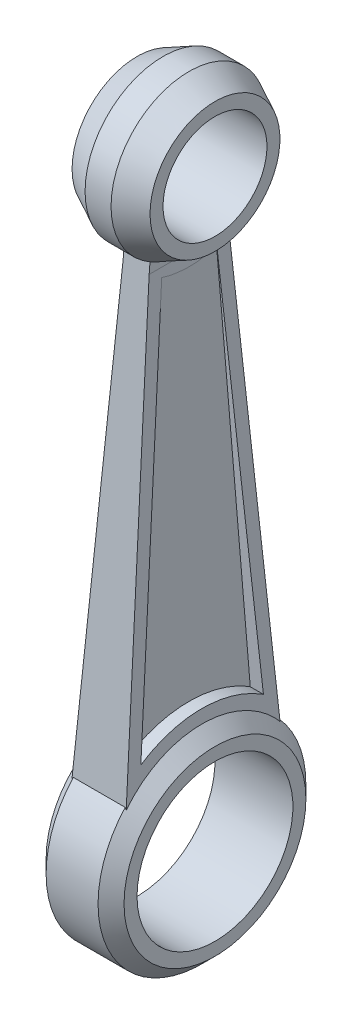
ISO-10303-21;
HEADER;
FILE_DESCRIPTION(('STEP AP214'),'2;1');
FILE_NAME('part.step','',(''),(''),'','','');
FILE_SCHEMA(('AUTOMOTIVE_DESIGN { 1 0 10303 214 1 1 1 1 }'));
ENDSEC;
DATA;
#1=APPLICATION_CONTEXT('core data for automotive mechanical design processes');
#2=APPLICATION_PROTOCOL_DEFINITION('international standard','automotive_design',2000,#1);
#3=PRODUCT_CONTEXT('',#1,'mechanical');
#4=PRODUCT('Part','Part','',(#3));
#5=PRODUCT_RELATED_PRODUCT_CATEGORY('part','',(#4));
#6=PRODUCT_DEFINITION_FORMATION('','',#4);
#7=PRODUCT_DEFINITION_CONTEXT('part definition',#1,'design');
#8=PRODUCT_DEFINITION('design','',#6,#7);
#9=PRODUCT_DEFINITION_SHAPE('','',#8);
#10=(LENGTH_UNIT() NAMED_UNIT(*) SI_UNIT(.MILLI.,.METRE.));
#11=(NAMED_UNIT(*) PLANE_ANGLE_UNIT() SI_UNIT($,.RADIAN.));
#12=(NAMED_UNIT(*) SI_UNIT($,.STERADIAN.) SOLID_ANGLE_UNIT());
#13=UNCERTAINTY_MEASURE_WITH_UNIT(LENGTH_MEASURE(1.E-05),#10,'distance_accuracy_value','');
#14=(GEOMETRIC_REPRESENTATION_CONTEXT(3) GLOBAL_UNCERTAINTY_ASSIGNED_CONTEXT((#13)) GLOBAL_UNIT_ASSIGNED_CONTEXT((#10,
#11,#12)) REPRESENTATION_CONTEXT('',''));
#15=CARTESIAN_POINT('',(0.,0.,0.));
#16=DIRECTION('',(0.,0.,1.));
#17=DIRECTION('',(1.,0.,0.));
#18=AXIS2_PLACEMENT_3D('',#15,#16,#17);
#19=CARTESIAN_POINT('',(0.,0.,-8.));
#20=DIRECTION('',(1.,0.,0.));
#21=DIRECTION('',(0.,0.,-1.));
#22=AXIS2_PLACEMENT_3D('',#19,#20,#21);
#23=PLANE('',#22);
#24=DIRECTION('',(0.,0.,-1.));
#25=VECTOR('',#24,1.);
#26=CARTESIAN_POINT('',(0.,38.9999999999999,-8.));
#27=LINE('',#26,#25);
#28=CARTESIAN_POINT('',(0.,39.0000000000003,3.06798331789926));
#29=VERTEX_POINT('',#28);
#30=CARTESIAN_POINT('',(0.,39.,0.));
#31=VERTEX_POINT('',#30);
#32=EDGE_CURVE('E291',#29,#31,#27,.T.);
#33=ORIENTED_EDGE('',*,*,#32,.F.);
#34=DIRECTION('',(0.,-0.996442825339413,0.0842715600283299));
#35=VECTOR('',#34,1.);
#36=CARTESIAN_POINT('',(0.,39.8038475772934,3.));
#37=LINE('',#36,#35);
#38=CARTESIAN_POINT('',(0.,39.8038475772934,3.));
#39=VERTEX_POINT('',#38);
#40=EDGE_CURVE('E501',#39,#29,#37,.T.);
#41=ORIENTED_EDGE('',*,*,#40,.F.);
#42=CARTESIAN_POINT('',(0.,45.,0.));
#43=DIRECTION('',(-1.,0.,0.));
#44=DIRECTION('',(0.,0.,1.));
#45=AXIS2_PLACEMENT_3D('',#42,#43,#44);
#46=CIRCLE('',#45,6.);
#47=EDGE_CURVE('E414',#31,#39,#46,.T.);
#48=ORIENTED_EDGE('',*,*,#47,.F.);
#49=EDGE_LOOP('',(#33,#41,#48));
#50=FACE_BOUND('',#49,.T.);
#51=ADVANCED_FACE('F41',(#50),#23,.F.);
#52=CARTESIAN_POINT('',(0.,39.0000000000003,-3.06798331789926));
#53=VERTEX_POINT('',#52);
#54=EDGE_CURVE('E68',#31,#53,#27,.T.);
#55=ORIENTED_EDGE('',*,*,#54,.F.);
#56=CARTESIAN_POINT('',(0.,39.8038475772934,-3.));
#57=VERTEX_POINT('',#56);
#58=EDGE_CURVE('E404',#57,#31,#46,.T.);
#59=ORIENTED_EDGE('',*,*,#58,.F.);
#60=DIRECTION('',(0.,-0.996442825339413,-0.0842715600283299));
#61=VECTOR('',#60,1.);
#62=CARTESIAN_POINT('',(0.,39.8038475772934,-3.));
#63=LINE('',#62,#61);
#64=EDGE_CURVE('E505',#57,#53,#63,.T.);
#65=ORIENTED_EDGE('',*,*,#64,.T.);
#66=EDGE_LOOP('',(#55,#59,#65));
#67=FACE_BOUND('',#66,.T.);
#68=ADVANCED_FACE('F383',(#67),#23,.F.);
#69=CARTESIAN_POINT('',(0.,45.,0.));
#70=DIRECTION('',(-1.,0.,0.));
#71=DIRECTION('',(0.,0.,1.));
#72=AXIS2_PLACEMENT_3D('',#69,#70,#71);
#73=CYLINDRICAL_SURFACE('',#72,6.);
#74=CARTESIAN_POINT('',(2.,45.,0.));
#75=DIRECTION('',(-1.,0.,0.));
#76=DIRECTION('',(0.,0.,1.));
#77=AXIS2_PLACEMENT_3D('',#74,#75,#76);
#78=CIRCLE('',#77,6.);
#79=CARTESIAN_POINT('',(2.,39.8038475772934,3.));
#80=VERTEX_POINT('',#79);
#81=CARTESIAN_POINT('',(2.,39.8038475772934,-3.));
#82=VERTEX_POINT('',#81);
#83=EDGE_CURVE('E488',#80,#82,#78,.T.);
#84=ORIENTED_EDGE('',*,*,#83,.T.);
#85=DIRECTION('',(-1.,0.,0.));
#86=VECTOR('',#85,1.);
#87=CARTESIAN_POINT('',(40.0032823696505,39.8038475772934,-3.));
#88=LINE('',#87,#86);
#89=EDGE_CURVE('E508',#82,#57,#88,.T.);
#90=ORIENTED_EDGE('',*,*,#89,.T.);
#91=CARTESIAN_POINT('',(0.,45.,0.));
#92=DIRECTION('',(-1.,0.,0.));
#93=DIRECTION('',(0.,0.,1.));
#94=AXIS2_PLACEMENT_3D('',#91,#92,#93);
#95=CIRCLE('',#94,6.);
#96=EDGE_CURVE('E286',#39,#57,#95,.T.);
#97=ORIENTED_EDGE('',*,*,#96,.F.);
#98=DIRECTION('',(-1.,0.,0.));
#99=VECTOR('',#98,1.);
#100=CARTESIAN_POINT('',(40.0032823696505,39.8038475772934,3.));
#101=LINE('',#100,#99);
#102=EDGE_CURVE('E511',#80,#39,#101,.T.);
#103=ORIENTED_EDGE('',*,*,#102,.F.);
#104=EDGE_LOOP('',(#84,#90,#97,#103));
#105=FACE_BOUND('',#104,.T.);
#106=ADVANCED_FACE('F264',(#105),#73,.T.);
#107=CARTESIAN_POINT('',(1.,38.3291143894341,-2.12115184999676));
#108=DIRECTION('',(0.,0.0842715600283032,-0.996442825339415));
#109=DIRECTION('',(0.,0.996442825339415,0.0842715600283032));
#110=AXIS2_PLACEMENT_3D('',#107,#108,#109);
#111=PLANE('',#110);
#112=DIRECTION('',(0.,0.996442825339415,0.0842715600283032));
#113=VECTOR('',#112,1.);
#114=CARTESIAN_POINT('',(2.,38.3291143894341,-2.12115184999676));
#115=LINE('',#114,#113);
#116=CARTESIAN_POINT('',(2.,7.61732768262882,-4.71852132391253));
#117=VERTEX_POINT('',#116);
#118=CARTESIAN_POINT('',(2.,38.3291143894341,-2.12115184999676));
#119=VERTEX_POINT('',#118);
#120=EDGE_CURVE('E461',#117,#119,#115,.T.);
#121=ORIENTED_EDGE('',*,*,#120,.F.);
#122=DIRECTION('',(1.,0.,0.));
#123=VECTOR('',#122,1.);
#124=CARTESIAN_POINT('',(1.,7.61732768262882,-4.71852132391253));
#125=LINE('',#124,#123);
#126=CARTESIAN_POINT('',(3.0123442683023,7.61732768262882,-4.71852132391253));
#127=VERTEX_POINT('',#126);
#128=EDGE_CURVE('E45',#117,#127,#125,.T.);
#129=ORIENTED_EDGE('',*,*,#128,.T.);
#130=DIRECTION('',(0.0321267246803745,-0.995928465091611,-0.0842280593482875));
#131=VECTOR('',#130,1.);
#132=CARTESIAN_POINT('',(2.01606152908188,38.5020925984616,-2.1065226679153));
#133=LINE('',#132,#131);
#134=CARTESIAN_POINT('',(2.02164147130858,38.3291143894341,-2.12115184999676));
#135=VERTEX_POINT('',#134);
#136=EDGE_CURVE('E313',#135,#127,#133,.T.);
#137=ORIENTED_EDGE('',*,*,#136,.F.);
#138=DIRECTION('',(1.,0.,0.));
#139=VECTOR('',#138,1.);
#140=CARTESIAN_POINT('',(1.,38.3291143894341,-2.12115184999676));
#141=LINE('',#140,#139);
#142=EDGE_CURVE('E280',#119,#135,#141,.T.);
#143=ORIENTED_EDGE('',*,*,#142,.F.);
#144=EDGE_LOOP('',(#121,#129,#137,#143));
#145=FACE_BOUND('',#144,.T.);
#146=ADVANCED_FACE('F260',(#145),#111,.F.);
#147=CARTESIAN_POINT('',(1.,5.88897669134315,6.68753942842204));
#148=CARTESIAN_POINT('',(1.,6.69200135886449,6.011047903356));
#149=CARTESIAN_POINT('',(1.,7.37167388711151,5.18868259476533));
#150=CARTESIAN_POINT('',(1.,8.39783470367684,3.35676888071733));
#151=CARTESIAN_POINT('',(1.,8.74403529045438,2.34773061242107));
#152=CARTESIAN_POINT('',(1.,9.05860896650734,0.271844027950155));
#153=CARTESIAN_POINT('',(1.,9.02689360030011,-0.794424505937804));
#154=CARTESIAN_POINT('',(1.,8.58949608324071,-2.84796005469057));
#155=CARTESIAN_POINT('',(1.,8.18393688992629,-3.83465369337448));
#156=CARTESIAN_POINT('',(1.,7.61732768262882,-4.71852132391253));
#157=B_SPLINE_CURVE_WITH_KNOTS('',3,(#147,#148,#149,#150,#151,#152,#153,#154,#155,#156),
.UNSPECIFIED.,.F.,.F.,(4,2,2,2,4),(0.,0.25,0.5,0.75,1.),.UNSPECIFIED.);
#158=DIRECTION('',(1.,0.,0.));
#159=VECTOR('',#158,1.);
#160=SURFACE_OF_LINEAR_EXTRUSION('',#157,#159);
#161=CARTESIAN_POINT('',(2.,5.88897669134315,6.68753942842204));
#162=CARTESIAN_POINT('',(2.,6.69200135886449,6.011047903356));
#163=CARTESIAN_POINT('',(2.,7.37167388711151,5.18868259476533));
#164=CARTESIAN_POINT('',(2.,8.39783470367684,3.35676888071733));
#165=CARTESIAN_POINT('',(2.,8.74403529045438,2.34773061242107));
#166=CARTESIAN_POINT('',(2.,9.05860896650734,0.271844027950155));
#167=CARTESIAN_POINT('',(2.,9.02689360030011,-0.794424505937804));
#168=CARTESIAN_POINT('',(2.,8.58949608324071,-2.84796005469057));
#169=CARTESIAN_POINT('',(2.,8.18393688992629,-3.83465369337448));
#170=CARTESIAN_POINT('',(2.,7.61732768262882,-4.71852132391253));
#171=B_SPLINE_CURVE_WITH_KNOTS('',3,(#161,#162,#163,#164,#165,#166,#167,#168,#169,#170),
.UNSPECIFIED.,.F.,.F.,(4,2,2,2,4),(0.,0.25,0.5,0.75,1.),.UNSPECIFIED.);
#172=CARTESIAN_POINT('',(2.,7.61718244429006,4.71853360706843));
#173=VERTEX_POINT('',#172);
#174=EDGE_CURVE('E464',#173,#117,#171,.T.);
#175=ORIENTED_EDGE('',*,*,#174,.F.);
#176=DIRECTION('',(1.,0.,0.));
#177=VECTOR('',#176,1.);
#178=CARTESIAN_POINT('',(1.,7.61718244429009,4.71853360706881));
#179=LINE('',#178,#177);
#180=CARTESIAN_POINT('',(3.01234895341,7.61718244429006,4.71853360706843));
#181=VERTEX_POINT('',#180);
#182=EDGE_CURVE('E290',#173,#181,#179,.T.);
#183=ORIENTED_EDGE('',*,*,#182,.T.);
#184=CARTESIAN_POINT('',(3.0123442683023,7.61732768262882,-4.71852132391253));
#185=CARTESIAN_POINT('',(3.00806607457309,7.74995168823409,-4.51163660127951));
#186=CARTESIAN_POINT('',(3.0040723500771,7.87375714760994,-4.29911223250506));
#187=CARTESIAN_POINT('',(2.99667510408751,8.1030717732873,-3.86437714513418));
#188=CARTESIAN_POINT('',(2.99327163103179,8.20857943801445,-3.64216563345114));
#189=CARTESIAN_POINT('',(2.98707961425944,8.4005319579572,-3.18988474838221));
#190=CARTESIAN_POINT('',(2.98429052669556,8.48699367243752,-2.95982253442265));
#191=CARTESIAN_POINT('',(2.97934437975339,8.64032422764476,-2.49326450214476));
#192=CARTESIAN_POINT('',(2.97718727357663,8.70719451912449,-2.25676916162011));
#193=CARTESIAN_POINT('',(2.97352759132997,8.82064466877101,-1.77884031019239));
#194=CARTESIAN_POINT('',(2.97202531178219,8.86721533475206,-1.53740461387068));
#195=CARTESIAN_POINT('',(2.96968350525666,8.93981133704346,-1.051446901121));
#196=CARTESIAN_POINT('',(2.96884402669693,8.96583517239512,-0.80692466054445));
#197=CARTESIAN_POINT('',(2.96782835873058,8.99732087935209,-0.316542312645348));
#198=CARTESIAN_POINT('',(2.96765224235739,9.00278048692085,-0.0706820609972036));
#199=CARTESIAN_POINT('',(2.96796567428867,8.99306409705136,0.420645282088476));
#200=CARTESIAN_POINT('',(2.96845516817631,8.97788978653444,0.666112404023711));
#201=CARTESIAN_POINT('',(2.96968966398492,8.93962041646739,1.0327251434016));
#202=CARTESIAN_POINT('',(2.97018490077011,8.92426807612647,1.15472361594661));
#203=CARTESIAN_POINT('',(2.97134254823125,8.88838100483116,1.39794611121684));
#204=CARTESIAN_POINT('',(2.9720049467998,8.86784664920606,1.51917018937914));
#205=CARTESIAN_POINT('',(2.97424005788787,8.79855820547612,1.88140510060333));
#206=CARTESIAN_POINT('',(2.97606072092915,8.74211765119631,2.12098901002031));
#207=CARTESIAN_POINT('',(2.98034116121264,8.6094240024082,2.59424679101913));
#208=CARTESIAN_POINT('',(2.98280016393749,8.53319491793767,2.82792745074108));
#209=CARTESIAN_POINT('',(2.98834038890523,8.36144794393781,3.2880829432097));
#210=CARTESIAN_POINT('',(2.9914215608281,8.2659316143288,3.51455835699107));
#211=CARTESIAN_POINT('',(2.99738621654168,8.08102728720791,3.90605372090437));
#212=CARTESIAN_POINT('',(3.00014376829974,7.99554318270809,4.07292796970002));
#213=CARTESIAN_POINT('',(3.00453448461541,7.85943097692219,4.31864038314751));
#214=CARTESIAN_POINT('',(3.00603899312213,7.81279121321404,4.39970743913832));
#215=CARTESIAN_POINT('',(3.00913167925438,7.71691794311424,4.56029730701337));
#216=CARTESIAN_POINT('',(3.01071986131245,7.66768429931392,4.63982003678219));
#217=CARTESIAN_POINT('',(3.01234895341,7.61718244429009,4.71853360706881));
#218=B_SPLINE_CURVE_WITH_KNOTS('',3,(#184,#185,#186,#187,#188,#189,#190,#191,#192,#193,#194,
#195,#196,#197,#198,#199,#200,#201,#202,#203,#204,#205,#206,#207,#208,#209,#210,#211,#212,#213,
#214,#215,#216,#217),.UNSPECIFIED.,.F.,.F.,(4,2,2,2,2,2,2,2,2,2,2,2,2,2,2,2,4),(0.,
0.737101300560762,1.47426306137045,2.21076964893497,2.94722168409539,3.68400685786495,
4.4208458492686,5.15776596123183,5.89462583007947,6.26341427178438,6.63217601009529,
7.36966821932185,8.10626975506051,8.84281173953634,9.40495797648502,9.68552872203038,
9.9661143455529),.UNSPECIFIED.);
#219=EDGE_CURVE('E316',#127,#181,#218,.T.);
#220=ORIENTED_EDGE('',*,*,#219,.F.);
#221=ORIENTED_EDGE('',*,*,#128,.F.);
#222=EDGE_LOOP('',(#175,#183,#220,#221));
#223=FACE_BOUND('',#222,.T.);
#224=ADVANCED_FACE('F263',(#223),#160,.F.);
#225=CARTESIAN_POINT('',(1.,7.6171824442906,4.71853360706801));
#226=DIRECTION('',(0.,0.0842715600283295,0.996442825339413));
#227=DIRECTION('',(0.,-0.996442825339413,0.0842715600283295));
#228=AXIS2_PLACEMENT_3D('',#225,#226,#227);
#229=PLANE('',#228);
#230=DIRECTION('',(0.,-0.996442825339413,0.0842715600283295));
#231=VECTOR('',#230,1.);
#232=CARTESIAN_POINT('',(2.,7.6171824442906,4.71853360706801));
#233=LINE('',#232,#231);
#234=CARTESIAN_POINT('',(2.,38.3291143894341,2.12115184999675));
#235=VERTEX_POINT('',#234);
#236=EDGE_CURVE('E409',#235,#173,#233,.T.);
#237=ORIENTED_EDGE('',*,*,#236,.F.);
#238=DIRECTION('',(1.,0.,0.));
#239=VECTOR('',#238,1.);
#240=CARTESIAN_POINT('',(1.,38.3291143894341,2.12115184999675));
#241=LINE('',#240,#239);
#242=CARTESIAN_POINT('',(2.02164147130858,38.3291143894341,2.12115184999675));
#243=VERTEX_POINT('',#242);
#244=EDGE_CURVE('E287',#235,#243,#241,.T.);
#245=ORIENTED_EDGE('',*,*,#244,.T.);
#246=DIRECTION('',(-0.0321267246803745,0.995928465091609,-0.0842280593483139));
#247=VECTOR('',#246,1.);
#248=CARTESIAN_POINT('',(1.97276598231316,39.8442545482921,1.99301281220998));
#249=LINE('',#248,#247);
#250=EDGE_CURVE('E325',#181,#243,#249,.T.);
#251=ORIENTED_EDGE('',*,*,#250,.F.);
#252=ORIENTED_EDGE('',*,*,#182,.F.);
#253=EDGE_LOOP('',(#237,#245,#251,#252));
#254=FACE_BOUND('',#253,.T.);
#255=ADVANCED_FACE('F270',(#254),#229,.F.);
#256=CARTESIAN_POINT('',(1.,45.,0.));
#257=DIRECTION('',(1.,0.,0.));
#258=DIRECTION('',(0.,0.,-1.));
#259=AXIS2_PLACEMENT_3D('',#256,#257,#258);
#260=CYLINDRICAL_SURFACE('',#259,7.);
#261=CARTESIAN_POINT('',(2.,45.,0.));
#262=DIRECTION('',(-1.,0.,0.));
#263=DIRECTION('',(0.,0.,1.));
#264=AXIS2_PLACEMENT_3D('',#261,#262,#263);
#265=CIRCLE('',#264,7.);
#266=EDGE_CURVE('E11',#119,#235,#265,.T.);
#267=ORIENTED_EDGE('',*,*,#266,.F.);
#268=ORIENTED_EDGE('',*,*,#142,.T.);
#269=CARTESIAN_POINT('',(1.80645161290323,45.,0.));
#270=DIRECTION('',(-0.9994801143397,-0.032241294010958,0.));
#271=DIRECTION('',(0.032241294010958,-0.9994801143397,0.));
#272=AXIS2_PLACEMENT_3D('',#269,#270,#271);
#273=ELLIPSE('',#272,7.00364109257392,7.);
#274=EDGE_CURVE('E539',#243,#135,#273,.F.);
#275=ORIENTED_EDGE('',*,*,#274,.F.);
#276=ORIENTED_EDGE('',*,*,#244,.F.);
#277=EDGE_LOOP('',(#267,#268,#275,#276));
#278=FACE_BOUND('',#277,.T.);
#279=ADVANCED_FACE('F333',(#278),#260,.T.);
#280=CARTESIAN_POINT('',(2.,39.,-8.));
#281=DIRECTION('',(-0.9994801143397,-0.032241294010958,0.));
#282=DIRECTION('',(0.032241294010958,-0.9994801143397,0.));
#283=AXIS2_PLACEMENT_3D('',#280,#281,#282);
#284=PLANE('',#283);
#285=DIRECTION('',(0.,0.,-1.));
#286=VECTOR('',#285,1.);
#287=CARTESIAN_POINT('',(2.,39.,-8.));
#288=LINE('',#287,#286);
#289=CARTESIAN_POINT('',(2.,39.0000000000003,3.06798331789925));
#290=VERTEX_POINT('',#289);
#291=CARTESIAN_POINT('',(2.,39.,0.));
#292=VERTEX_POINT('',#291);
#293=EDGE_CURVE('E60',#290,#292,#288,.T.);
#294=ORIENTED_EDGE('',*,*,#293,.F.);
#295=DIRECTION('',(-0.0321267246803745,0.995928465091609,-0.0842280593483142));
#296=VECTOR('',#295,1.);
#297=CARTESIAN_POINT('',(2.01332038910498,38.5870679377456,3.10290597295482));
#298=LINE('',#297,#296);
#299=CARTESIAN_POINT('',(3.0888807757667,5.24469595123221,5.92275035428325));
#300=VERTEX_POINT('',#299);
#301=EDGE_CURVE('E514',#300,#290,#298,.T.);
#302=ORIENTED_EDGE('',*,*,#301,.F.);
#303=CARTESIAN_POINT('',(3.25,0.25,0.));
#304=DIRECTION('',(-0.9994801143397,-0.032241294010958,0.));
#305=DIRECTION('',(-0.032241294010958,0.9994801143397,0.));
#306=AXIS2_PLACEMENT_3D('',#303,#304,#305);
#307=ELLIPSE('',#306,7.75403120963541,7.74596669241484);
#308=CARTESIAN_POINT('',(3.0888807757667,5.24469595123221,-5.92275035428325));
#309=VERTEX_POINT('',#308);
#310=EDGE_CURVE('E357',#300,#309,#307,.T.);
#311=ORIENTED_EDGE('',*,*,#310,.T.);
#312=DIRECTION('',(-0.0321267246803745,0.995928465091609,0.0842280593483142));
#313=VECTOR('',#312,1.);
#314=CARTESIAN_POINT('',(2.01332038910498,38.5870679377456,-3.10290597295482));
#315=LINE('',#314,#313);
#316=CARTESIAN_POINT('',(2.,39.0000000000003,-3.06798331789925));
#317=VERTEX_POINT('',#316);
#318=EDGE_CURVE('E518',#309,#317,#315,.T.);
#319=ORIENTED_EDGE('',*,*,#318,.T.);
#320=EDGE_CURVE('E453',#292,#317,#288,.T.);
#321=ORIENTED_EDGE('',*,*,#320,.F.);
#322=EDGE_LOOP('',(#294,#302,#311,#319,#321));
#323=FACE_BOUND('',#322,.T.);
#324=ORIENTED_EDGE('',*,*,#274,.T.);
#325=ORIENTED_EDGE('',*,*,#136,.T.);
#326=ORIENTED_EDGE('',*,*,#219,.T.);
#327=ORIENTED_EDGE('',*,*,#250,.T.);
#328=EDGE_LOOP('',(#324,#325,#326,#327));
#329=FACE_BOUND('',#328,.T.);
#330=ADVANCED_FACE('F327',(#323,#329),#284,.F.);
#331=CARTESIAN_POINT('',(4.,0.,0.));
#332=DIRECTION('',(-1.,0.,0.));
#333=DIRECTION('',(0.,0.,1.));
#334=AXIS2_PLACEMENT_3D('',#331,#332,#333);
#335=CONICAL_SURFACE('',#334,7.,0.785398163397448);
#336=CARTESIAN_POINT('',(4.,0.,0.));
#337=DIRECTION('',(-1.,0.,0.));
#338=DIRECTION('',(0.,0.,1.));
#339=AXIS2_PLACEMENT_3D('',#336,#337,#338);
#340=CIRCLE('',#339,7.);
#341=CARTESIAN_POINT('',(4.,0.,7.));
#342=VERTEX_POINT('',#341);
#343=EDGE_CURVE('E526',#342,#342,#340,.T.);
#344=ORIENTED_EDGE('',*,*,#343,.T.);
#345=EDGE_LOOP('',(#344));
#346=FACE_BOUND('',#345,.T.);
#347=CARTESIAN_POINT('',(2.9998,5.39179340287246,5.91030996993737));
#348=CARTESIAN_POINT('',(3.01978271852244,5.35911867481869,5.91307335006974));
#349=CARTESIAN_POINT('',(3.03966955682411,5.32638648699748,5.91584158971249));
#350=CARTESIAN_POINT('',(3.07925147549855,5.26080718765727,5.92138778837078));
#351=CARTESIAN_POINT('',(3.09894655584696,5.22796007612367,5.92416574738757));
#352=CARTESIAN_POINT('',(3.11854575595027,5.19505550480804,5.92694856591595));
#353=B_SPLINE_CURVE_WITH_KNOTS('',3,(#347,#348,#349,#350,#351,#352),.UNSPECIFIED.,.F.,.F.,(4,2,
4),(0.,0.115199437807989,0.230398890241448),.UNSPECIFIED.);
#354=CARTESIAN_POINT('',(3.,5.39146631945272,5.91033763216679));
#355=VERTEX_POINT('',#354);
#356=EDGE_CURVE('E356',#355,#300,#353,.T.);
#357=ORIENTED_EDGE('',*,*,#356,.F.);
#358=CARTESIAN_POINT('',(3.,0.,0.));
#359=DIRECTION('',(-1.,0.,0.));
#360=DIRECTION('',(0.,0.,1.));
#361=AXIS2_PLACEMENT_3D('',#358,#359,#360);
#362=CIRCLE('',#361,8.);
#363=CARTESIAN_POINT('',(3.,5.39146631945272,-5.91033763216679));
#364=VERTEX_POINT('',#363);
#365=EDGE_CURVE('E523',#364,#355,#362,.T.);
#366=ORIENTED_EDGE('',*,*,#365,.F.);
#367=CARTESIAN_POINT('',(2.9998,5.39179340287246,-5.91030996993737));
#368=CARTESIAN_POINT('',(3.01978271852244,5.35911867481869,-5.91307335006974));
#369=CARTESIAN_POINT('',(3.03966955682412,5.32638648699748,-5.91584158971249));
#370=CARTESIAN_POINT('',(3.07925147549856,5.26080718765726,-5.92138778837078));
#371=CARTESIAN_POINT('',(3.09894655584697,5.22796007612366,-5.92416574738757));
#372=CARTESIAN_POINT('',(3.11854575595028,5.19505550480803,-5.92694856591595));
#373=B_SPLINE_CURVE_WITH_KNOTS('',3,(#367,#368,#369,#370,#371,#372),.UNSPECIFIED.,.F.,.F.,(4,2,
4),(0.,0.115199437807997,0.230398890241465),.UNSPECIFIED.);
#374=EDGE_CURVE('E346',#364,#309,#373,.T.);
#375=ORIENTED_EDGE('',*,*,#374,.T.);
#376=ORIENTED_EDGE('',*,*,#310,.F.);
#377=EDGE_LOOP('',(#357,#366,#375,#376));
#378=FACE_BOUND('',#377,.T.);
#379=ADVANCED_FACE('F332',(#346,#378),#335,.T.);
#380=CARTESIAN_POINT('',(0.,0.,0.));
#381=DIRECTION('',(-1.,0.,0.));
#382=DIRECTION('',(0.,0.,1.));
#383=AXIS2_PLACEMENT_3D('',#380,#381,#382);
#384=CYLINDRICAL_SURFACE('',#383,8.);
#385=DIRECTION('',(-1.,0.,0.));
#386=VECTOR('',#385,1.);
#387=CARTESIAN_POINT('',(0.,5.39146631945272,-5.91033763216679));
#388=LINE('',#387,#386);
#389=CARTESIAN_POINT('',(-0.999999999999997,5.39146631945272,-5.91033763216679));
#390=VERTEX_POINT('',#389);
#391=EDGE_CURVE('E533',#390,#364,#388,.F.);
#392=ORIENTED_EDGE('',*,*,#391,.T.);
#393=ORIENTED_EDGE('',*,*,#365,.T.);
#394=DIRECTION('',(-1.,0.,0.));
#395=VECTOR('',#394,1.);
#396=CARTESIAN_POINT('',(0.,5.39146631945272,5.91033763216679));
#397=LINE('',#396,#395);
#398=CARTESIAN_POINT('',(-0.999999999999997,5.39146631945272,5.91033763216679));
#399=VERTEX_POINT('',#398);
#400=EDGE_CURVE('E536',#399,#355,#397,.F.);
#401=ORIENTED_EDGE('',*,*,#400,.F.);
#402=CARTESIAN_POINT('',(-0.999999999999997,0.,0.));
#403=DIRECTION('',(-1.,0.,0.));
#404=DIRECTION('',(0.,0.,1.));
#405=AXIS2_PLACEMENT_3D('',#402,#403,#404);
#406=CIRCLE('',#405,8.);
#407=EDGE_CURVE('E602',#390,#399,#406,.T.);
#408=ORIENTED_EDGE('',*,*,#407,.F.);
#409=EDGE_LOOP('',(#392,#393,#401,#408));
#410=FACE_BOUND('',#409,.T.);
#411=ADVANCED_FACE('F367',(#410),#384,.T.);
#412=CARTESIAN_POINT('',(0.,0.,0.));
#413=DIRECTION('',(-1.,0.,0.));
#414=DIRECTION('',(0.,0.,1.));
#415=AXIS2_PLACEMENT_3D('',#412,#413,#414);
#416=CYLINDRICAL_SURFACE('',#415,6.);
#417=CARTESIAN_POINT('',(4.,0.,0.));
#418=DIRECTION('',(-1.,0.,0.));
#419=DIRECTION('',(0.,0.,1.));
#420=AXIS2_PLACEMENT_3D('',#417,#418,#419);
#421=CIRCLE('',#420,6.);
#422=CARTESIAN_POINT('',(4.,0.,6.));
#423=VERTEX_POINT('',#422);
#424=EDGE_CURVE('E529',#423,#423,#421,.T.);
#425=ORIENTED_EDGE('',*,*,#424,.F.);
#426=EDGE_LOOP('',(#425));
#427=FACE_BOUND('',#426,.T.);
#428=CARTESIAN_POINT('',(-2.,0.,0.));
#429=DIRECTION('',(-1.,0.,0.));
#430=DIRECTION('',(0.,0.,1.));
#431=AXIS2_PLACEMENT_3D('',#428,#429,#430);
#432=CIRCLE('',#431,6.);
#433=CARTESIAN_POINT('',(-2.,0.,6.));
#434=VERTEX_POINT('',#433);
#435=EDGE_CURVE('E194',#434,#434,#432,.T.);
#436=ORIENTED_EDGE('',*,*,#435,.T.);
#437=EDGE_LOOP('',(#436));
#438=FACE_BOUND('',#437,.T.);
#439=ADVANCED_FACE('F372',(#427,#438),#416,.F.);
#440=CARTESIAN_POINT('',(4.,0.,-6.));
#441=DIRECTION('',(-1.,0.,0.));
#442=DIRECTION('',(0.,0.,1.));
#443=AXIS2_PLACEMENT_3D('',#440,#441,#442);
#444=PLANE('',#443);
#445=ORIENTED_EDGE('',*,*,#343,.F.);
#446=EDGE_LOOP('',(#445));
#447=FACE_BOUND('',#446,.T.);
#448=ORIENTED_EDGE('',*,*,#424,.T.);
#449=EDGE_LOOP('',(#448));
#450=FACE_BOUND('',#449,.T.);
#451=ADVANCED_FACE('F369',(#447,#450),#444,.F.);
#452=CARTESIAN_POINT('',(40.0032823696505,39.8038475772934,3.));
#453=DIRECTION('',(0.,-0.0842715600283299,-0.996442825339413));
#454=DIRECTION('',(0.,0.996442825339413,-0.0842715600283299));
#455=AXIS2_PLACEMENT_3D('',#452,#453,#454);
#456=PLANE('',#455);
#457=ORIENTED_EDGE('',*,*,#40,.T.);
#458=DIRECTION('',(0.0321267246803745,0.995928465091609,-0.0842280593483142));
#459=VECTOR('',#458,1.);
#460=CARTESIAN_POINT('',(-0.0133203891049816,38.5870679377456,3.10290597295482));
#461=LINE('',#460,#459);
#462=CARTESIAN_POINT('',(-1.0888807757667,5.24469595123221,5.92275035428325));
#463=VERTEX_POINT('',#462);
#464=EDGE_CURVE('E427',#463,#29,#461,.T.);
#465=ORIENTED_EDGE('',*,*,#464,.F.);
#466=CARTESIAN_POINT('',(-0.999799999999997,5.39179340287246,5.91030996993737));
#467=CARTESIAN_POINT('',(-1.01978271852244,5.35911867481869,5.91307335006974));
#468=CARTESIAN_POINT('',(-1.03966955682411,5.32638648699748,5.91584158971249));
#469=CARTESIAN_POINT('',(-1.07925147549855,5.26080718765727,5.92138778837078));
#470=CARTESIAN_POINT('',(-1.09894655584696,5.22796007612367,5.92416574738757));
#471=CARTESIAN_POINT('',(-1.11854575595027,5.19505550480804,5.92694856591595));
#472=B_SPLINE_CURVE_WITH_KNOTS('',3,(#466,#467,#468,#469,#470,#471),.UNSPECIFIED.,.F.,.F.,(4,2,
4),(0.,0.115199437807989,0.230398890241448),.UNSPECIFIED.);
#473=EDGE_CURVE('E237',#399,#463,#472,.T.);
#474=ORIENTED_EDGE('',*,*,#473,.F.);
#475=ORIENTED_EDGE('',*,*,#400,.T.);
#476=ORIENTED_EDGE('',*,*,#356,.T.);
#477=ORIENTED_EDGE('',*,*,#301,.T.);
#478=DIRECTION('',(0.,-0.996442825339413,0.0842715600283299));
#479=VECTOR('',#478,1.);
#480=CARTESIAN_POINT('',(2.,39.8038475772934,3.));
#481=LINE('',#480,#479);
#482=EDGE_CURVE('E426',#80,#290,#481,.T.);
#483=ORIENTED_EDGE('',*,*,#482,.F.);
#484=ORIENTED_EDGE('',*,*,#102,.T.);
#485=EDGE_LOOP('',(#457,#465,#474,#475,#476,#477,#483,#484));
#486=FACE_BOUND('',#485,.T.);
#487=ADVANCED_FACE('F341',(#486),#456,.F.);
#488=CARTESIAN_POINT('',(40.0032823696505,39.8038475772934,-3.));
#489=DIRECTION('',(0.,0.0842715600283299,-0.996442825339413));
#490=DIRECTION('',(0.,0.996442825339413,0.0842715600283299));
#491=AXIS2_PLACEMENT_3D('',#488,#489,#490);
#492=PLANE('',#491);
#493=ORIENTED_EDGE('',*,*,#374,.F.);
#494=ORIENTED_EDGE('',*,*,#391,.F.);
#495=CARTESIAN_POINT('',(-0.999799999999997,5.39179340287246,-5.91030996993737));
#496=CARTESIAN_POINT('',(-1.01978271852244,5.35911867481869,-5.91307335006974));
#497=CARTESIAN_POINT('',(-1.03966955682412,5.32638648699748,-5.91584158971249));
#498=CARTESIAN_POINT('',(-1.07925147549855,5.26080718765726,-5.92138778837078));
#499=CARTESIAN_POINT('',(-1.09894655584697,5.22796007612366,-5.92416574738757));
#500=CARTESIAN_POINT('',(-1.11854575595028,5.19505550480803,-5.92694856591595));
#501=B_SPLINE_CURVE_WITH_KNOTS('',3,(#495,#496,#497,#498,#499,#500),.UNSPECIFIED.,.F.,.F.,(4,2,
4),(0.,0.115199437807997,0.230398890241465),.UNSPECIFIED.);
#502=CARTESIAN_POINT('',(-1.0888807757667,5.24469595123221,-5.92275035428325));
#503=VERTEX_POINT('',#502);
#504=EDGE_CURVE('E229',#390,#503,#501,.T.);
#505=ORIENTED_EDGE('',*,*,#504,.T.);
#506=DIRECTION('',(0.0321267246803745,0.995928465091609,0.0842280593483142));
#507=VECTOR('',#506,1.);
#508=CARTESIAN_POINT('',(-0.0133203891049816,38.5870679377456,-3.10290597295482));
#509=LINE('',#508,#507);
#510=EDGE_CURVE('E431',#503,#53,#509,.T.);
#511=ORIENTED_EDGE('',*,*,#510,.T.);
#512=ORIENTED_EDGE('',*,*,#64,.F.);
#513=ORIENTED_EDGE('',*,*,#89,.F.);
#514=DIRECTION('',(0.,-0.996442825339413,-0.0842715600283299));
#515=VECTOR('',#514,1.);
#516=CARTESIAN_POINT('',(2.,39.8038475772934,-3.));
#517=LINE('',#516,#515);
#518=EDGE_CURVE('E432',#82,#317,#517,.T.);
#519=ORIENTED_EDGE('',*,*,#518,.T.);
#520=ORIENTED_EDGE('',*,*,#318,.F.);
#521=EDGE_LOOP('',(#493,#494,#505,#511,#512,#513,#519,#520));
#522=FACE_BOUND('',#521,.T.);
#523=ADVANCED_FACE('F337',(#522),#492,.T.);
#524=CARTESIAN_POINT('',(0.,45.,0.));
#525=DIRECTION('',(-1.,0.,0.));
#526=DIRECTION('',(0.,0.,1.));
#527=AXIS2_PLACEMENT_3D('',#524,#525,#526);
#528=CYLINDRICAL_SURFACE('',#527,4.);
#529=CARTESIAN_POINT('',(4.,45.,0.));
#530=DIRECTION('',(-1.,0.,0.));
#531=DIRECTION('',(0.,0.,1.));
#532=AXIS2_PLACEMENT_3D('',#529,#530,#531);
#533=CIRCLE('',#532,4.);
#534=CARTESIAN_POINT('',(4.,45.,4.));
#535=VERTEX_POINT('',#534);
#536=EDGE_CURVE('E497',#535,#535,#533,.T.);
#537=ORIENTED_EDGE('',*,*,#536,.F.);
#538=EDGE_LOOP('',(#537));
#539=FACE_BOUND('',#538,.T.);
#540=CARTESIAN_POINT('',(-2.,45.,0.));
#541=DIRECTION('',(-1.,0.,0.));
#542=DIRECTION('',(0.,0.,1.));
#543=AXIS2_PLACEMENT_3D('',#540,#541,#542);
#544=CIRCLE('',#543,4.);
#545=CARTESIAN_POINT('',(-2.,45.,4.));
#546=VERTEX_POINT('',#545);
#547=EDGE_CURVE('E422',#546,#546,#544,.T.);
#548=ORIENTED_EDGE('',*,*,#547,.T.);
#549=EDGE_LOOP('',(#548));
#550=FACE_BOUND('',#549,.T.);
#551=ADVANCED_FACE('F335',(#539,#550),#528,.F.);
#552=CARTESIAN_POINT('',(4.,49.,0.));
#553=DIRECTION('',(-1.,0.,0.));
#554=DIRECTION('',(0.,0.,1.));
#555=AXIS2_PLACEMENT_3D('',#552,#553,#554);
#556=PLANE('',#555);
#557=CARTESIAN_POINT('',(4.,45.,0.));
#558=DIRECTION('',(-1.,0.,0.));
#559=DIRECTION('',(0.,0.,1.));
#560=AXIS2_PLACEMENT_3D('',#557,#558,#559);
#561=CIRCLE('',#560,5.);
#562=CARTESIAN_POINT('',(4.,45.,5.));
#563=VERTEX_POINT('',#562);
#564=EDGE_CURVE('E494',#563,#563,#561,.T.);
#565=ORIENTED_EDGE('',*,*,#564,.F.);
#566=EDGE_LOOP('',(#565));
#567=FACE_BOUND('',#566,.T.);
#568=ORIENTED_EDGE('',*,*,#536,.T.);
#569=EDGE_LOOP('',(#568));
#570=FACE_BOUND('',#569,.T.);
#571=ADVANCED_FACE('F556',(#567,#570),#556,.F.);
#572=CARTESIAN_POINT('',(4.,45.,0.));
#573=DIRECTION('',(-1.,0.,0.));
#574=DIRECTION('',(0.,0.,1.));
#575=AXIS2_PLACEMENT_3D('',#572,#573,#574);
#576=CONICAL_SURFACE('',#575,5.,0.463647609000807);
#577=EDGE_CURVE('E491',#292,#80,#78,.T.);
#578=ORIENTED_EDGE('',*,*,#577,.F.);
#579=CARTESIAN_POINT('',(2.,45.,0.));
#580=DIRECTION('',(-1.,0.,0.));
#581=DIRECTION('',(0.,0.,1.));
#582=AXIS2_PLACEMENT_3D('',#579,#580,#581);
#583=CIRCLE('',#582,6.);
#584=EDGE_CURVE('E456',#82,#292,#583,.T.);
#585=ORIENTED_EDGE('',*,*,#584,.F.);
#586=ORIENTED_EDGE('',*,*,#83,.F.);
#587=EDGE_LOOP('',(#578,#585,#586));
#588=FACE_BOUND('',#587,.T.);
#589=ORIENTED_EDGE('',*,*,#564,.T.);
#590=EDGE_LOOP('',(#589));
#591=FACE_BOUND('',#590,.T.);
#592=ADVANCED_FACE('F554',(#588,#591),#576,.T.);
#593=CARTESIAN_POINT('',(1.,5.88897669134315,6.68753942842204));
#594=CARTESIAN_POINT('',(1.,6.69200135886449,6.011047903356));
#595=CARTESIAN_POINT('',(1.,7.37167388711151,5.18868259476533));
#596=CARTESIAN_POINT('',(1.,8.39783470367684,3.35676888071733));
#597=CARTESIAN_POINT('',(1.,8.74403529045438,2.34773061242107));
#598=CARTESIAN_POINT('',(1.,9.05860896650734,0.271844027950155));
#599=CARTESIAN_POINT('',(1.,9.02689360030011,-0.794424505937804));
#600=CARTESIAN_POINT('',(1.,8.58949608324071,-2.84796005469057));
#601=CARTESIAN_POINT('',(1.,8.18393688992629,-3.83465369337448));
#602=CARTESIAN_POINT('',(1.,7.61732768262882,-4.71852132391253));
#603=B_SPLINE_CURVE_WITH_KNOTS('',3,(#593,#594,#595,#596,#597,#598,#599,#600,#601,#602),
.UNSPECIFIED.,.F.,.F.,(4,2,2,2,4),(0.,0.25,0.5,0.75,1.),.UNSPECIFIED.);
#604=DIRECTION('',(-1.,0.,0.));
#605=VECTOR('',#604,1.);
#606=SURFACE_OF_LINEAR_EXTRUSION('',#603,#605);
#607=CARTESIAN_POINT('',(0.,5.88897669134315,6.68753942842204));
#608=CARTESIAN_POINT('',(0.,6.69200135886449,6.011047903356));
#609=CARTESIAN_POINT('',(0.,7.37167388711151,5.18868259476533));
#610=CARTESIAN_POINT('',(0.,8.39783470367684,3.35676888071733));
#611=CARTESIAN_POINT('',(0.,8.74403529045438,2.34773061242107));
#612=CARTESIAN_POINT('',(0.,9.05860896650734,0.271844027950155));
#613=CARTESIAN_POINT('',(0.,9.02689360030011,-0.794424505937804));
#614=CARTESIAN_POINT('',(0.,8.58949608324071,-2.84796005469057));
#615=CARTESIAN_POINT('',(0.,8.18393688992629,-3.83465369337448));
#616=CARTESIAN_POINT('',(0.,7.61732768262882,-4.71852132391253));
#617=B_SPLINE_CURVE_WITH_KNOTS('',3,(#607,#608,#609,#610,#611,#612,#613,#614,#615,#616),
.UNSPECIFIED.,.F.,.F.,(4,2,2,2,4),(0.,0.25,0.5,0.75,1.),.UNSPECIFIED.);
#618=CARTESIAN_POINT('',(0.,7.61732768262882,-4.71852132391253));
#619=VERTEX_POINT('',#618);
#620=CARTESIAN_POINT('',(0.,7.61718244429006,4.71853360706843));
#621=VERTEX_POINT('',#620);
#622=EDGE_CURVE('E300',#619,#621,#617,.F.);
#623=ORIENTED_EDGE('',*,*,#622,.F.);
#624=DIRECTION('',(-1.,0.,0.));
#625=VECTOR('',#624,1.);
#626=CARTESIAN_POINT('',(1.,7.61732768262882,-4.71852132391253));
#627=LINE('',#626,#625);
#628=CARTESIAN_POINT('',(-1.01234426830229,7.61732768262882,-4.71852132391253));
#629=VERTEX_POINT('',#628);
#630=EDGE_CURVE('E398',#619,#629,#627,.T.);
#631=ORIENTED_EDGE('',*,*,#630,.T.);
#632=CARTESIAN_POINT('',(-1.01234426830229,7.61732768262882,-4.71852132391253));
#633=CARTESIAN_POINT('',(-1.00806607457309,7.74995168823409,-4.51163660127951));
#634=CARTESIAN_POINT('',(-1.0040723500771,7.87375714760994,-4.29911223250506));
#635=CARTESIAN_POINT('',(-0.996675104087504,8.1030717732873,-3.86437714513418));
#636=CARTESIAN_POINT('',(-0.993271631031789,8.20857943801445,-3.64216563345114));
#637=CARTESIAN_POINT('',(-0.987079614259443,8.4005319579572,-3.18988474838221));
#638=CARTESIAN_POINT('',(-0.984290526695561,8.48699367243752,-2.95982253442265));
#639=CARTESIAN_POINT('',(-0.979344379753392,8.64032422764476,-2.49326450214476));
#640=CARTESIAN_POINT('',(-0.977187273576627,8.70719451912449,-2.25676916162011));
#641=CARTESIAN_POINT('',(-0.973527591329965,8.82064466877101,-1.77884031019239));
#642=CARTESIAN_POINT('',(-0.972025311782189,8.86721533475206,-1.53740461387068));
#643=CARTESIAN_POINT('',(-0.96968350525666,8.93981133704346,-1.051446901121));
#644=CARTESIAN_POINT('',(-0.968844026696929,8.96583517239512,-0.80692466054445));
#645=CARTESIAN_POINT('',(-0.967828358730575,8.99732087935209,-0.316542312645348));
#646=CARTESIAN_POINT('',(-0.96765224235739,9.00278048692085,-0.0706820609972036));
#647=CARTESIAN_POINT('',(-0.967965674288663,8.99306409705136,0.420645282088476));
#648=CARTESIAN_POINT('',(-0.968455168176306,8.97788978653444,0.666112404023711));
#649=CARTESIAN_POINT('',(-0.969689663984921,8.93962041646739,1.0327251434016));
#650=CARTESIAN_POINT('',(-0.970184900770112,8.92426807612647,1.15472361594661));
#651=CARTESIAN_POINT('',(-0.971342548231251,8.88838100483116,1.39794611121684));
#652=CARTESIAN_POINT('',(-0.972004946799802,8.86784664920606,1.51917018937914));
#653=CARTESIAN_POINT('',(-0.974240057887865,8.79855820547612,1.88140510060333));
#654=CARTESIAN_POINT('',(-0.976060720929149,8.74211765119631,2.12098901002031));
#655=CARTESIAN_POINT('',(-0.980341161212636,8.6094240024082,2.59424679101913));
#656=CARTESIAN_POINT('',(-0.982800163937492,8.53319491793767,2.82792745074108));
#657=CARTESIAN_POINT('',(-0.988340388905229,8.36144794393781,3.2880829432097));
#658=CARTESIAN_POINT('',(-0.9914215608281,8.2659316143288,3.51455835699107));
#659=CARTESIAN_POINT('',(-0.997386216541677,8.08102728720791,3.90605372090437));
#660=CARTESIAN_POINT('',(-1.00014376829974,7.99554318270809,4.07292796970002));
#661=CARTESIAN_POINT('',(-1.00453448461541,7.85943097692219,4.31864038314751));
#662=CARTESIAN_POINT('',(-1.00603899312213,7.81279121321404,4.39970743913832));
#663=CARTESIAN_POINT('',(-1.00913167925438,7.71691794311424,4.56029730701337));
#664=CARTESIAN_POINT('',(-1.01071986131245,7.66768429931392,4.63982003678219));
#665=CARTESIAN_POINT('',(-1.01234895340999,7.61718244429009,4.71853360706881));
#666=B_SPLINE_CURVE_WITH_KNOTS('',3,(#632,#633,#634,#635,#636,#637,#638,#639,#640,#641,#642,
#643,#644,#645,#646,#647,#648,#649,#650,#651,#652,#653,#654,#655,#656,#657,#658,#659,#660,#661,
#662,#663,#664,#665),.UNSPECIFIED.,.F.,.F.,(4,2,2,2,2,2,2,2,2,2,2,2,2,2,2,2,4),(0.,
0.737101300560762,1.47426306137045,2.21076964893497,2.94722168409539,3.68400685786495,
4.4208458492686,5.15776596123183,5.89462583007947,6.26341427178438,6.63217601009529,
7.36966821932185,8.10626975506051,8.84281173953634,9.40495797648502,9.68552872203038,
9.9661143455529),.UNSPECIFIED.);
#667=CARTESIAN_POINT('',(-1.01234895341,7.61718244429006,4.71853360706843));
#668=VERTEX_POINT('',#667);
#669=EDGE_CURVE('E187',#629,#668,#666,.T.);
#670=ORIENTED_EDGE('',*,*,#669,.T.);
#671=DIRECTION('',(-1.,0.,0.));
#672=VECTOR('',#671,1.);
#673=CARTESIAN_POINT('',(1.,7.61718244429009,4.71853360706881));
#674=LINE('',#673,#672);
#675=EDGE_CURVE('E177',#621,#668,#674,.T.);
#676=ORIENTED_EDGE('',*,*,#675,.F.);
#677=EDGE_LOOP('',(#623,#631,#670,#676));
#678=FACE_BOUND('',#677,.T.);
#679=ADVANCED_FACE('F211',(#678),#606,.T.);
#680=CARTESIAN_POINT('',(-2.,0.,-6.));
#681=DIRECTION('',(1.,0.,0.));
#682=DIRECTION('',(0.,0.,1.));
#683=AXIS2_PLACEMENT_3D('',#680,#681,#682);
#684=PLANE('',#683);
#685=CARTESIAN_POINT('',(-2.,0.,0.));
#686=DIRECTION('',(-1.,0.,0.));
#687=DIRECTION('',(0.,0.,1.));
#688=AXIS2_PLACEMENT_3D('',#685,#686,#687);
#689=CIRCLE('',#688,7.);
#690=CARTESIAN_POINT('',(-2.,0.,7.));
#691=VERTEX_POINT('',#690);
#692=EDGE_CURVE('E198',#691,#691,#689,.T.);
#693=ORIENTED_EDGE('',*,*,#692,.T.);
#694=EDGE_LOOP('',(#693));
#695=FACE_BOUND('',#694,.T.);
#696=ORIENTED_EDGE('',*,*,#435,.F.);
#697=EDGE_LOOP('',(#696));
#698=FACE_BOUND('',#697,.T.);
#699=ADVANCED_FACE('F248',(#695,#698),#684,.F.);
#700=CARTESIAN_POINT('',(-2.,0.,0.));
#701=DIRECTION('',(1.,0.,0.));
#702=DIRECTION('',(0.,0.,1.));
#703=AXIS2_PLACEMENT_3D('',#700,#701,#702);
#704=CONICAL_SURFACE('',#703,7.,0.785398163397448);
#705=ORIENTED_EDGE('',*,*,#692,.F.);
#706=EDGE_LOOP('',(#705));
#707=FACE_BOUND('',#706,.T.);
#708=ORIENTED_EDGE('',*,*,#473,.T.);
#709=CARTESIAN_POINT('',(-1.25,0.25,0.));
#710=DIRECTION('',(-0.9994801143397,0.032241294010958,0.));
#711=DIRECTION('',(0.032241294010958,0.9994801143397,0.));
#712=AXIS2_PLACEMENT_3D('',#709,#710,#711);
#713=ELLIPSE('',#712,7.75403120963541,7.74596669241484);
#714=EDGE_CURVE('E238',#463,#503,#713,.T.);
#715=ORIENTED_EDGE('',*,*,#714,.T.);
#716=ORIENTED_EDGE('',*,*,#504,.F.);
#717=ORIENTED_EDGE('',*,*,#407,.T.);
#718=EDGE_LOOP('',(#708,#715,#716,#717));
#719=FACE_BOUND('',#718,.T.);
#720=ADVANCED_FACE('F220',(#707,#719),#704,.T.);
#721=CARTESIAN_POINT('',(0.,39.,-8.));
#722=DIRECTION('',(0.9994801143397,-0.032241294010958,0.));
#723=DIRECTION('',(-0.032241294010958,-0.9994801143397,0.));
#724=AXIS2_PLACEMENT_3D('',#721,#722,#723);
#725=PLANE('',#724);
#726=ORIENTED_EDGE('',*,*,#464,.T.);
#727=ORIENTED_EDGE('',*,*,#32,.T.);
#728=ORIENTED_EDGE('',*,*,#54,.T.);
#729=ORIENTED_EDGE('',*,*,#510,.F.);
#730=ORIENTED_EDGE('',*,*,#714,.F.);
#731=EDGE_LOOP('',(#726,#727,#728,#729,#730));
#732=FACE_BOUND('',#731,.T.);
#733=CARTESIAN_POINT('',(0.193548387096776,45.,0.));
#734=DIRECTION('',(-0.9994801143397,0.032241294010958,0.));
#735=DIRECTION('',(-0.032241294010958,-0.9994801143397,0.));
#736=AXIS2_PLACEMENT_3D('',#733,#734,#735);
#737=ELLIPSE('',#736,7.00364109257392,7.);
#738=CARTESIAN_POINT('',(-0.0216414713085757,38.3291143894341,2.12115184999675));
#739=VERTEX_POINT('',#738);
#740=CARTESIAN_POINT('',(-0.0216414713085757,38.3291143894341,-2.12115184999676));
#741=VERTEX_POINT('',#740);
#742=EDGE_CURVE('E172',#739,#741,#737,.F.);
#743=ORIENTED_EDGE('',*,*,#742,.F.);
#744=DIRECTION('',(0.0321267246803745,0.995928465091609,-0.0842280593483139));
#745=VECTOR('',#744,1.);
#746=CARTESIAN_POINT('',(0.0272340176868421,39.8442545482921,1.99301281220998));
#747=LINE('',#746,#745);
#748=EDGE_CURVE('E180',#668,#739,#747,.T.);
#749=ORIENTED_EDGE('',*,*,#748,.F.);
#750=ORIENTED_EDGE('',*,*,#669,.F.);
#751=DIRECTION('',(-0.0321267246803745,-0.995928465091611,-0.0842280593482875));
#752=VECTOR('',#751,1.);
#753=CARTESIAN_POINT('',(-0.0160615290818811,38.5020925984616,-2.1065226679153));
#754=LINE('',#753,#752);
#755=EDGE_CURVE('E192',#741,#629,#754,.T.);
#756=ORIENTED_EDGE('',*,*,#755,.F.);
#757=EDGE_LOOP('',(#743,#749,#750,#756));
#758=FACE_BOUND('',#757,.T.);
#759=ADVANCED_FACE('F190',(#732,#758),#725,.F.);
#760=CARTESIAN_POINT('',(1.,45.,0.));
#761=DIRECTION('',(-1.,0.,0.));
#762=DIRECTION('',(0.,0.,-1.));
#763=AXIS2_PLACEMENT_3D('',#760,#761,#762);
#764=CYLINDRICAL_SURFACE('',#763,7.);
#765=DIRECTION('',(-1.,0.,0.));
#766=VECTOR('',#765,1.);
#767=CARTESIAN_POINT('',(1.,38.3291143894341,-2.12115184999676));
#768=LINE('',#767,#766);
#769=CARTESIAN_POINT('',(0.,38.3291143894341,-2.12115184999676));
#770=VERTEX_POINT('',#769);
#771=EDGE_CURVE('E400',#770,#741,#768,.T.);
#772=ORIENTED_EDGE('',*,*,#771,.F.);
#773=CARTESIAN_POINT('',(0.,45.,0.));
#774=DIRECTION('',(1.,0.,0.));
#775=DIRECTION('',(0.,0.,-1.));
#776=AXIS2_PLACEMENT_3D('',#773,#774,#775);
#777=CIRCLE('',#776,7.);
#778=CARTESIAN_POINT('',(0.,38.3291143894341,2.12115184999675));
#779=VERTEX_POINT('',#778);
#780=EDGE_CURVE('E173',#770,#779,#777,.F.);
#781=ORIENTED_EDGE('',*,*,#780,.T.);
#782=DIRECTION('',(-1.,0.,0.));
#783=VECTOR('',#782,1.);
#784=CARTESIAN_POINT('',(1.,38.3291143894341,2.12115184999675));
#785=LINE('',#784,#783);
#786=EDGE_CURVE('E167',#779,#739,#785,.T.);
#787=ORIENTED_EDGE('',*,*,#786,.T.);
#788=ORIENTED_EDGE('',*,*,#742,.T.);
#789=EDGE_LOOP('',(#772,#781,#787,#788));
#790=FACE_BOUND('',#789,.T.);
#791=ADVANCED_FACE('F170',(#790),#764,.T.);
#792=CARTESIAN_POINT('',(1.,7.6171824442906,4.71853360706801));
#793=DIRECTION('',(0.,0.0842715600283295,0.996442825339413));
#794=DIRECTION('',(0.,-0.996442825339413,0.0842715600283295));
#795=AXIS2_PLACEMENT_3D('',#792,#793,#794);
#796=PLANE('',#795);
#797=ORIENTED_EDGE('',*,*,#786,.F.);
#798=DIRECTION('',(0.,-0.996442825339413,0.0842715600283295));
#799=VECTOR('',#798,1.);
#800=CARTESIAN_POINT('',(0.,1.12209296338798,5.26783890503412));
#801=LINE('',#800,#799);
#802=EDGE_CURVE('E305',#779,#621,#801,.T.);
#803=ORIENTED_EDGE('',*,*,#802,.T.);
#804=ORIENTED_EDGE('',*,*,#675,.T.);
#805=ORIENTED_EDGE('',*,*,#748,.T.);
#806=EDGE_LOOP('',(#797,#803,#804,#805));
#807=FACE_BOUND('',#806,.T.);
#808=ADVANCED_FACE('F181',(#807),#796,.F.);
#809=CARTESIAN_POINT('',(1.,38.3291143894341,-2.12115184999676));
#810=DIRECTION('',(0.,0.0842715600283032,-0.996442825339415));
#811=DIRECTION('',(0.,0.996442825339415,0.0842715600283032));
#812=AXIS2_PLACEMENT_3D('',#809,#810,#811);
#813=PLANE('',#812);
#814=ORIENTED_EDGE('',*,*,#630,.F.);
#815=DIRECTION('',(0.,0.996442825339415,0.0842715600283032));
#816=VECTOR('',#815,1.);
#817=CARTESIAN_POINT('',(0.,-0.221455698538259,-5.38146603830683));
#818=LINE('',#817,#816);
#819=EDGE_CURVE('E52',#619,#770,#818,.T.);
#820=ORIENTED_EDGE('',*,*,#819,.T.);
#821=ORIENTED_EDGE('',*,*,#771,.T.);
#822=ORIENTED_EDGE('',*,*,#755,.T.);
#823=EDGE_LOOP('',(#814,#820,#821,#822));
#824=FACE_BOUND('',#823,.T.);
#825=ADVANCED_FACE('F389',(#824),#813,.F.);
#826=ORIENTED_EDGE('',*,*,#819,.F.);
#827=ORIENTED_EDGE('',*,*,#622,.T.);
#828=ORIENTED_EDGE('',*,*,#802,.F.);
#829=ORIENTED_EDGE('',*,*,#780,.F.);
#830=EDGE_LOOP('',(#826,#827,#828,#829));
#831=FACE_BOUND('',#830,.T.);
#832=ADVANCED_FACE('F43',(#831),#23,.F.);
#833=CARTESIAN_POINT('',(2.,0.,-8.));
#834=DIRECTION('',(-1.,0.,0.));
#835=DIRECTION('',(0.,0.,-1.));
#836=AXIS2_PLACEMENT_3D('',#833,#834,#835);
#837=PLANE('',#836);
#838=ORIENTED_EDGE('',*,*,#174,.T.);
#839=ORIENTED_EDGE('',*,*,#120,.T.);
#840=ORIENTED_EDGE('',*,*,#266,.T.);
#841=ORIENTED_EDGE('',*,*,#236,.T.);
#842=EDGE_LOOP('',(#838,#839,#840,#841));
#843=FACE_BOUND('',#842,.T.);
#844=ADVANCED_FACE('F254',(#843),#837,.F.);
#845=ORIENTED_EDGE('',*,*,#482,.T.);
#846=ORIENTED_EDGE('',*,*,#293,.T.);
#847=ORIENTED_EDGE('',*,*,#577,.T.);
#848=EDGE_LOOP('',(#845,#846,#847));
#849=FACE_BOUND('',#848,.T.);
#850=ADVANCED_FACE('F257',(#849),#837,.F.);
#851=ORIENTED_EDGE('',*,*,#584,.T.);
#852=ORIENTED_EDGE('',*,*,#320,.T.);
#853=ORIENTED_EDGE('',*,*,#518,.F.);
#854=EDGE_LOOP('',(#851,#852,#853));
#855=FACE_BOUND('',#854,.T.);
#856=ADVANCED_FACE('F259',(#855),#837,.F.);
#857=CARTESIAN_POINT('',(-2.,49.,0.));
#858=DIRECTION('',(1.,0.,0.));
#859=DIRECTION('',(0.,0.,1.));
#860=AXIS2_PLACEMENT_3D('',#857,#858,#859);
#861=PLANE('',#860);
#862=CARTESIAN_POINT('',(-2.,45.,0.));
#863=DIRECTION('',(-1.,0.,0.));
#864=DIRECTION('',(0.,0.,1.));
#865=AXIS2_PLACEMENT_3D('',#862,#863,#864);
#866=CIRCLE('',#865,5.);
#867=CARTESIAN_POINT('',(-2.,45.,5.));
#868=VERTEX_POINT('',#867);
#869=EDGE_CURVE('E418',#868,#868,#866,.T.);
#870=ORIENTED_EDGE('',*,*,#869,.T.);
#871=EDGE_LOOP('',(#870));
#872=FACE_BOUND('',#871,.T.);
#873=ORIENTED_EDGE('',*,*,#547,.F.);
#874=EDGE_LOOP('',(#873));
#875=FACE_BOUND('',#874,.T.);
#876=ADVANCED_FACE('F222',(#872,#875),#861,.F.);
#877=CARTESIAN_POINT('',(-2.,45.,0.));
#878=DIRECTION('',(1.,0.,0.));
#879=DIRECTION('',(0.,0.,1.));
#880=AXIS2_PLACEMENT_3D('',#877,#878,#879);
#881=CONICAL_SURFACE('',#880,5.,0.463647609000807);
#882=ORIENTED_EDGE('',*,*,#47,.T.);
#883=ORIENTED_EDGE('',*,*,#96,.T.);
#884=ORIENTED_EDGE('',*,*,#58,.T.);
#885=EDGE_LOOP('',(#882,#883,#884));
#886=FACE_BOUND('',#885,.T.);
#887=ORIENTED_EDGE('',*,*,#869,.F.);
#888=EDGE_LOOP('',(#887));
#889=FACE_BOUND('',#888,.T.);
#890=ADVANCED_FACE('F571',(#886,#889),#881,.T.);
#891=CLOSED_SHELL('',(#51,#68,#106,#146,#224,#255,#279,#330,#379,#411,#439,#451,#487,#523,#551,
#571,#592,#679,#699,#720,#759,#791,#808,#825,#832,#844,#850,#856,#876,#890));
#892=MANIFOLD_SOLID_BREP('B2',#891);
#893=ADVANCED_BREP_SHAPE_REPRESENTATION('',(#18,#892),#14);
#894=SHAPE_DEFINITION_REPRESENTATION(#9,#893);
ENDSEC;
END-ISO-10303-21;
